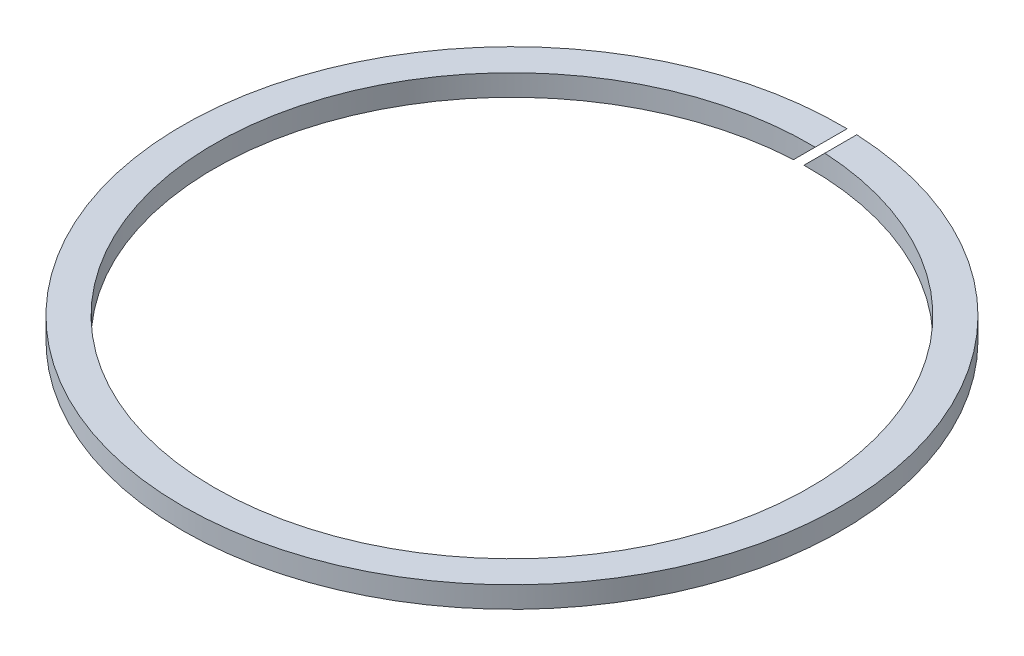
ISO-10303-21;
HEADER;
FILE_DESCRIPTION(('STEP AP214'),'2;1');
FILE_NAME('part.step','',(''),(''),'','','');
FILE_SCHEMA(('AUTOMOTIVE_DESIGN { 1 0 10303 214 1 1 1 1 }'));
ENDSEC;
DATA;
#1=APPLICATION_CONTEXT('core data for automotive mechanical design processes');
#2=APPLICATION_PROTOCOL_DEFINITION('international standard','automotive_design',2000,#1);
#3=PRODUCT_CONTEXT('',#1,'mechanical');
#4=PRODUCT('Part','Part','',(#3));
#5=PRODUCT_RELATED_PRODUCT_CATEGORY('part','',(#4));
#6=PRODUCT_DEFINITION_FORMATION('','',#4);
#7=PRODUCT_DEFINITION_CONTEXT('part definition',#1,'design');
#8=PRODUCT_DEFINITION('design','',#6,#7);
#9=PRODUCT_DEFINITION_SHAPE('','',#8);
#10=(LENGTH_UNIT() NAMED_UNIT(*) SI_UNIT(.MILLI.,.METRE.));
#11=(NAMED_UNIT(*) PLANE_ANGLE_UNIT() SI_UNIT($,.RADIAN.));
#12=(NAMED_UNIT(*) SI_UNIT($,.STERADIAN.) SOLID_ANGLE_UNIT());
#13=UNCERTAINTY_MEASURE_WITH_UNIT(LENGTH_MEASURE(1.E-05),#10,'distance_accuracy_value','');
#14=(GEOMETRIC_REPRESENTATION_CONTEXT(3) GLOBAL_UNCERTAINTY_ASSIGNED_CONTEXT((#13)) GLOBAL_UNIT_ASSIGNED_CONTEXT((#10,
#11,#12)) REPRESENTATION_CONTEXT('',''));
#15=CARTESIAN_POINT('',(0.,0.,0.));
#16=DIRECTION('',(0.,0.,1.));
#17=DIRECTION('',(1.,0.,0.));
#18=AXIS2_PLACEMENT_3D('',#15,#16,#17);
#19=CARTESIAN_POINT('',(0.,1.5,0.));
#20=DIRECTION('',(0.,1.,0.));
#21=DIRECTION('',(0.,0.,1.));
#22=AXIS2_PLACEMENT_3D('',#19,#20,#21);
#23=PLANE('',#22);
#24=CARTESIAN_POINT('',(0.,1.5,0.));
#25=DIRECTION('',(0.,1.,0.));
#26=DIRECTION('',(0.,0.,1.));
#27=AXIS2_PLACEMENT_3D('',#24,#25,#26);
#28=CIRCLE('',#27,42.);
#29=CARTESIAN_POINT('',(0.792893218813193,1.5,-41.9925150514179));
#30=VERTEX_POINT('',#29);
#31=CARTESIAN_POINT('',(2.20710678118629,1.5,-41.9419679993255));
#32=VERTEX_POINT('',#31);
#33=EDGE_CURVE('E90',#30,#32,#28,.T.);
#34=ORIENTED_EDGE('',*,*,#33,.F.);
#35=DIRECTION('',(0.,0.,-1.));
#36=VECTOR('',#35,1.);
#37=CARTESIAN_POINT('',(0.792893218813193,1.5,0.));
#38=LINE('',#37,#36);
#39=CARTESIAN_POINT('',(0.792893218813193,1.5,-46.4932395122512));
#40=VERTEX_POINT('',#39);
#41=EDGE_CURVE('E63',#30,#40,#38,.T.);
#42=ORIENTED_EDGE('',*,*,#41,.T.);
#43=CARTESIAN_POINT('',(0.,1.5,0.));
#44=DIRECTION('',(0.,1.,0.));
#45=DIRECTION('',(0.,0.,1.));
#46=AXIS2_PLACEMENT_3D('',#43,#44,#45);
#47=CIRCLE('',#46,46.5);
#48=CARTESIAN_POINT('',(2.20710678118629,1.5,-46.4475906765512));
#49=VERTEX_POINT('',#48);
#50=EDGE_CURVE('E86',#40,#49,#47,.T.);
#51=ORIENTED_EDGE('',*,*,#50,.T.);
#52=DIRECTION('',(0.,0.,-1.));
#53=VECTOR('',#52,1.);
#54=CARTESIAN_POINT('',(2.20710678118629,1.5,0.));
#55=LINE('',#54,#53);
#56=EDGE_CURVE('E79',#32,#49,#55,.T.);
#57=ORIENTED_EDGE('',*,*,#56,.F.);
#58=EDGE_LOOP('',(#34,#42,#51,#57));
#59=FACE_BOUND('',#58,.T.);
#60=ADVANCED_FACE('F39',(#59),#23,.T.);
#61=CARTESIAN_POINT('',(0.,-1.5,0.));
#62=DIRECTION('',(0.,1.,0.));
#63=DIRECTION('',(0.,0.,1.));
#64=AXIS2_PLACEMENT_3D('',#61,#62,#63);
#65=PLANE('',#64);
#66=DIRECTION('',(0.,0.,-1.));
#67=VECTOR('',#66,1.);
#68=CARTESIAN_POINT('',(-2.20710678118684,-1.5,0.));
#69=LINE('',#68,#67);
#70=CARTESIAN_POINT('',(-2.20710678118684,-1.5,-41.9419679993254));
#71=VERTEX_POINT('',#70);
#72=CARTESIAN_POINT('',(-2.20710678118684,-1.5,-46.4475906765511));
#73=VERTEX_POINT('',#72);
#74=EDGE_CURVE('E113',#71,#73,#69,.T.);
#75=ORIENTED_EDGE('',*,*,#74,.F.);
#76=CARTESIAN_POINT('',(0.,-1.5,0.));
#77=DIRECTION('',(0.,1.,0.));
#78=DIRECTION('',(0.,0.,1.));
#79=AXIS2_PLACEMENT_3D('',#76,#77,#78);
#80=CIRCLE('',#79,42.);
#81=CARTESIAN_POINT('',(-0.79289321881374,-1.5,-41.9925150514179));
#82=VERTEX_POINT('',#81);
#83=EDGE_CURVE('E98',#71,#82,#80,.T.);
#84=ORIENTED_EDGE('',*,*,#83,.T.);
#85=DIRECTION('',(0.,0.,-1.));
#86=VECTOR('',#85,1.);
#87=CARTESIAN_POINT('',(-0.792893218813739,-1.5,0.));
#88=LINE('',#87,#86);
#89=CARTESIAN_POINT('',(-0.792893218813739,-1.5,-46.4932395122512));
#90=VERTEX_POINT('',#89);
#91=EDGE_CURVE('E55',#82,#90,#88,.T.);
#92=ORIENTED_EDGE('',*,*,#91,.T.);
#93=CARTESIAN_POINT('',(0.,-1.5,0.));
#94=DIRECTION('',(0.,1.,0.));
#95=DIRECTION('',(0.,0.,1.));
#96=AXIS2_PLACEMENT_3D('',#93,#94,#95);
#97=CIRCLE('',#96,46.5);
#98=EDGE_CURVE('E97',#73,#90,#97,.T.);
#99=ORIENTED_EDGE('',*,*,#98,.F.);
#100=EDGE_LOOP('',(#75,#84,#92,#99));
#101=FACE_BOUND('',#100,.T.);
#102=ADVANCED_FACE('F122',(#101),#65,.F.);
#103=CARTESIAN_POINT('',(0.,1.5,0.));
#104=DIRECTION('',(0.,-1.,0.));
#105=DIRECTION('',(0.,0.,-1.));
#106=AXIS2_PLACEMENT_3D('',#103,#104,#105);
#107=CYLINDRICAL_SURFACE('',#106,46.5);
#108=CARTESIAN_POINT('',(0.,0.707106781186815,0.));
#109=DIRECTION('',(0.707106781186544,-0.707106781186551,0.));
#110=DIRECTION('',(-0.707106781186551,-0.707106781186544,0.));
#111=AXIS2_PLACEMENT_3D('',#108,#109,#110);
#112=ELLIPSE('',#111,65.7609306503486,46.5);
#113=EDGE_CURVE('E104',#73,#40,#112,.T.);
#114=ORIENTED_EDGE('',*,*,#113,.F.);
#115=ORIENTED_EDGE('',*,*,#98,.T.);
#116=CARTESIAN_POINT('',(0.,-0.707106781186268,0.));
#117=DIRECTION('',(0.707106781186544,-0.707106781186551,0.));
#118=DIRECTION('',(-0.707106781186551,-0.707106781186544,0.));
#119=AXIS2_PLACEMENT_3D('',#116,#117,#118);
#120=ELLIPSE('',#119,65.7609306503486,46.5);
#121=EDGE_CURVE('E93',#90,#49,#120,.T.);
#122=ORIENTED_EDGE('',*,*,#121,.T.);
#123=ORIENTED_EDGE('',*,*,#50,.F.);
#124=EDGE_LOOP('',(#114,#115,#122,#123));
#125=FACE_BOUND('',#124,.T.);
#126=ADVANCED_FACE('F41',(#125),#107,.T.);
#127=CARTESIAN_POINT('',(0.,1.5,0.));
#128=DIRECTION('',(0.,-1.,0.));
#129=DIRECTION('',(0.,0.,-1.));
#130=AXIS2_PLACEMENT_3D('',#127,#128,#129);
#131=CYLINDRICAL_SURFACE('',#130,42.);
#132=ORIENTED_EDGE('',*,*,#83,.F.);
#133=CARTESIAN_POINT('',(0.,0.707106781186815,0.));
#134=DIRECTION('',(0.707106781186544,-0.707106781186551,0.));
#135=DIRECTION('',(-0.707106781186551,-0.707106781186544,0.));
#136=AXIS2_PLACEMENT_3D('',#133,#134,#135);
#137=ELLIPSE('',#136,59.3969696196697,42.);
#138=EDGE_CURVE('E11',#71,#30,#137,.T.);
#139=ORIENTED_EDGE('',*,*,#138,.T.);
#140=ORIENTED_EDGE('',*,*,#33,.T.);
#141=CARTESIAN_POINT('',(0.,-0.707106781186268,0.));
#142=DIRECTION('',(0.707106781186544,-0.707106781186551,0.));
#143=DIRECTION('',(-0.707106781186551,-0.707106781186544,0.));
#144=AXIS2_PLACEMENT_3D('',#141,#142,#143);
#145=ELLIPSE('',#144,59.3969696196697,42.);
#146=EDGE_CURVE('E48',#82,#32,#145,.T.);
#147=ORIENTED_EDGE('',*,*,#146,.F.);
#148=EDGE_LOOP('',(#132,#139,#140,#147));
#149=FACE_BOUND('',#148,.T.);
#150=ADVANCED_FACE('F95',(#149),#131,.F.);
#151=CARTESIAN_POINT('',(-10.5688220446858,-11.2759288258719,-66.));
#152=DIRECTION('',(0.707106781186544,-0.707106781186551,0.));
#153=DIRECTION('',(0.707106781186551,0.707106781186544,0.));
#154=AXIS2_PLACEMENT_3D('',#151,#152,#153);
#155=PLANE('',#154);
#156=ORIENTED_EDGE('',*,*,#91,.F.);
#157=ORIENTED_EDGE('',*,*,#146,.T.);
#158=ORIENTED_EDGE('',*,*,#56,.T.);
#159=ORIENTED_EDGE('',*,*,#121,.F.);
#160=EDGE_LOOP('',(#156,#157,#158,#159));
#161=FACE_BOUND('',#160,.T.);
#162=ADVANCED_FACE('F78',(#161),#155,.F.);
#163=CARTESIAN_POINT('',(-11.2759288258723,-10.5688220446854,-66.));
#164=DIRECTION('',(0.707106781186544,-0.707106781186551,0.));
#165=DIRECTION('',(0.707106781186551,0.707106781186544,0.));
#166=AXIS2_PLACEMENT_3D('',#163,#164,#165);
#167=PLANE('',#166);
#168=ORIENTED_EDGE('',*,*,#113,.T.);
#169=ORIENTED_EDGE('',*,*,#41,.F.);
#170=ORIENTED_EDGE('',*,*,#138,.F.);
#171=ORIENTED_EDGE('',*,*,#74,.T.);
#172=EDGE_LOOP('',(#168,#169,#170,#171));
#173=FACE_BOUND('',#172,.T.);
#174=ADVANCED_FACE('F125',(#173),#167,.T.);
#175=CLOSED_SHELL('',(#60,#102,#126,#150,#162,#174));
#176=MANIFOLD_SOLID_BREP('B2',#175);
#177=ADVANCED_BREP_SHAPE_REPRESENTATION('',(#18,#176),#14);
#178=SHAPE_DEFINITION_REPRESENTATION(#9,#177);
ENDSEC;
END-ISO-10303-21;
